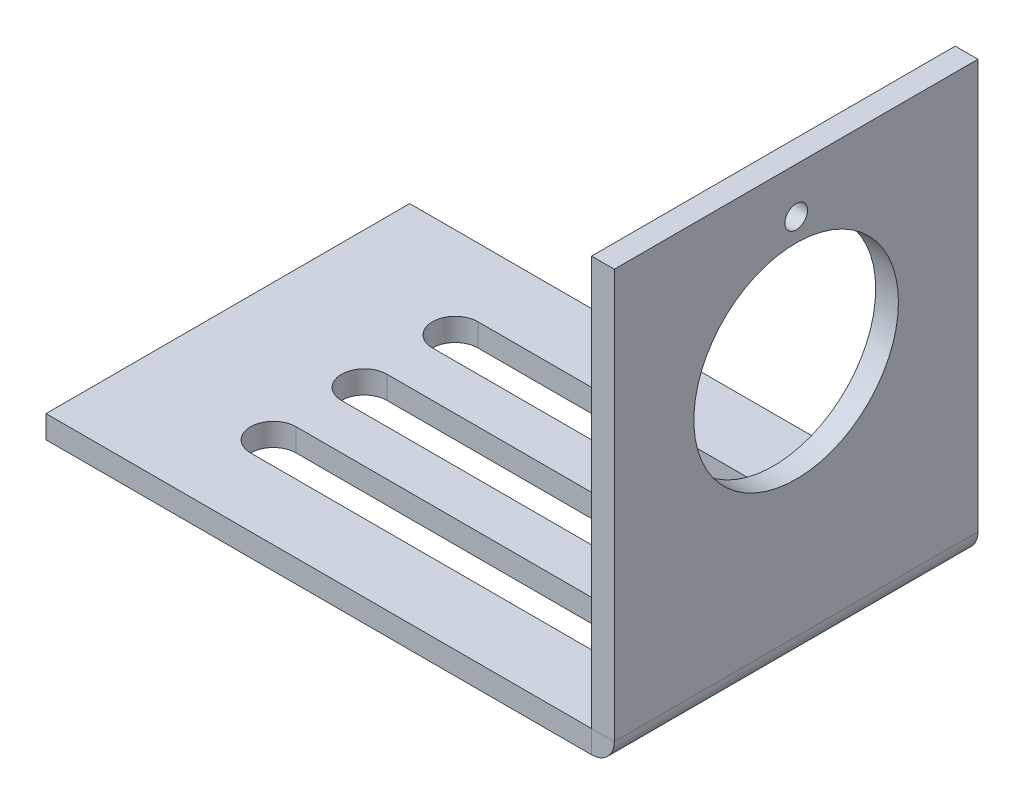
ISO-10303-21;
HEADER;
FILE_DESCRIPTION(('STEP AP214'),'2;1');
FILE_NAME('part.step','',(''),(''),'','','');
FILE_SCHEMA(('AUTOMOTIVE_DESIGN { 1 0 10303 214 1 1 1 1 }'));
ENDSEC;
DATA;
#1=APPLICATION_CONTEXT('core data for automotive mechanical design processes');
#2=APPLICATION_PROTOCOL_DEFINITION('international standard','automotive_design',2000,#1);
#3=PRODUCT_CONTEXT('',#1,'mechanical');
#4=PRODUCT('Part','Part','',(#3));
#5=PRODUCT_RELATED_PRODUCT_CATEGORY('part','',(#4));
#6=PRODUCT_DEFINITION_FORMATION('','',#4);
#7=PRODUCT_DEFINITION_CONTEXT('part definition',#1,'design');
#8=PRODUCT_DEFINITION('design','',#6,#7);
#9=PRODUCT_DEFINITION_SHAPE('','',#8);
#10=(LENGTH_UNIT() NAMED_UNIT(*) SI_UNIT(.MILLI.,.METRE.));
#11=(NAMED_UNIT(*) PLANE_ANGLE_UNIT() SI_UNIT($,.RADIAN.));
#12=(NAMED_UNIT(*) SI_UNIT($,.STERADIAN.) SOLID_ANGLE_UNIT());
#13=UNCERTAINTY_MEASURE_WITH_UNIT(LENGTH_MEASURE(1.E-05),#10,'distance_accuracy_value','');
#14=(GEOMETRIC_REPRESENTATION_CONTEXT(3) GLOBAL_UNCERTAINTY_ASSIGNED_CONTEXT((#13)) GLOBAL_UNIT_ASSIGNED_CONTEXT((#10,
#11,#12)) REPRESENTATION_CONTEXT('',''));
#15=CARTESIAN_POINT('',(0.,0.,0.));
#16=DIRECTION('',(0.,0.,1.));
#17=DIRECTION('',(1.,0.,0.));
#18=AXIS2_PLACEMENT_3D('',#15,#16,#17);
#19=CARTESIAN_POINT('',(19.05,1.5875,-12.7));
#20=DIRECTION('',(0.,0.,1.));
#21=DIRECTION('',(1.,0.,0.));
#22=AXIS2_PLACEMENT_3D('',#19,#20,#21);
#23=CYLINDRICAL_SURFACE('',#22,1.5875);
#24=CARTESIAN_POINT('',(19.05,1.5875,12.7));
#25=DIRECTION('',(0.,0.,1.));
#26=DIRECTION('',(1.,0.,0.));
#27=AXIS2_PLACEMENT_3D('',#24,#25,#26);
#28=CIRCLE('',#27,1.5875);
#29=CARTESIAN_POINT('',(19.05,0.,12.7));
#30=VERTEX_POINT('',#29);
#31=CARTESIAN_POINT('',(20.6375,1.5875,12.7));
#32=VERTEX_POINT('',#31);
#33=EDGE_CURVE('E96',#30,#32,#28,.T.);
#34=ORIENTED_EDGE('',*,*,#33,.F.);
#35=DIRECTION('',(0.,0.,1.));
#36=VECTOR('',#35,1.);
#37=CARTESIAN_POINT('',(19.05,0.,-12.7));
#38=LINE('',#37,#36);
#39=CARTESIAN_POINT('',(19.05,0.,-12.7));
#40=VERTEX_POINT('',#39);
#41=EDGE_CURVE('E12',#40,#30,#38,.T.);
#42=ORIENTED_EDGE('',*,*,#41,.F.);
#43=CARTESIAN_POINT('',(19.05,1.5875,-12.7));
#44=DIRECTION('',(0.,0.,1.));
#45=DIRECTION('',(1.,0.,0.));
#46=AXIS2_PLACEMENT_3D('',#43,#44,#45);
#47=CIRCLE('',#46,1.5875);
#48=CARTESIAN_POINT('',(20.6375,1.5875,-12.7));
#49=VERTEX_POINT('',#48);
#50=EDGE_CURVE('E88',#40,#49,#47,.T.);
#51=ORIENTED_EDGE('',*,*,#50,.T.);
#52=DIRECTION('',(0.,0.,1.));
#53=VECTOR('',#52,1.);
#54=CARTESIAN_POINT('',(20.6375,1.5875,-12.7));
#55=LINE('',#54,#53);
#56=EDGE_CURVE('E47',#49,#32,#55,.T.);
#57=ORIENTED_EDGE('',*,*,#56,.T.);
#58=EDGE_LOOP('',(#34,#42,#51,#57));
#59=FACE_BOUND('',#58,.T.);
#60=ADVANCED_FACE('F44',(#59),#23,.T.);
#61=CARTESIAN_POINT('',(19.05,1.5875,-12.7));
#62=DIRECTION('',(-1.,0.,0.));
#63=DIRECTION('',(0.,0.,1.));
#64=AXIS2_PLACEMENT_3D('',#61,#62,#63);
#65=PLANE('',#64);
#66=DIRECTION('',(0.,-1.,0.));
#67=VECTOR('',#66,1.);
#68=CARTESIAN_POINT('',(19.05,1.5875,12.7));
#69=LINE('',#68,#67);
#70=CARTESIAN_POINT('',(19.05,1.5875,12.7));
#71=VERTEX_POINT('',#70);
#72=EDGE_CURVE('E90',#71,#30,#69,.T.);
#73=ORIENTED_EDGE('',*,*,#72,.F.);
#74=DIRECTION('',(0.,0.,1.));
#75=VECTOR('',#74,1.);
#76=CARTESIAN_POINT('',(19.05,1.5875,-12.7));
#77=LINE('',#76,#75);
#78=CARTESIAN_POINT('',(19.05,1.5875,-12.7));
#79=VERTEX_POINT('',#78);
#80=EDGE_CURVE('E53',#79,#71,#77,.T.);
#81=ORIENTED_EDGE('',*,*,#80,.F.);
#82=DIRECTION('',(0.,-1.,0.));
#83=VECTOR('',#82,1.);
#84=CARTESIAN_POINT('',(19.05,1.5875,-12.7));
#85=LINE('',#84,#83);
#86=EDGE_CURVE('E85',#79,#40,#85,.T.);
#87=ORIENTED_EDGE('',*,*,#86,.T.);
#88=ORIENTED_EDGE('',*,*,#41,.T.);
#89=EDGE_LOOP('',(#73,#81,#87,#88));
#90=FACE_BOUND('',#89,.T.);
#91=ADVANCED_FACE('F100',(#90),#65,.T.);
#92=CARTESIAN_POINT('',(20.6375,1.5875,-12.7));
#93=DIRECTION('',(0.,1.,0.));
#94=DIRECTION('',(-1.,0.,0.));
#95=AXIS2_PLACEMENT_3D('',#92,#93,#94);
#96=PLANE('',#95);
#97=DIRECTION('',(-1.,0.,0.));
#98=VECTOR('',#97,1.);
#99=CARTESIAN_POINT('',(20.6375,1.5875,12.7));
#100=LINE('',#99,#98);
#101=EDGE_CURVE('E83',#32,#71,#100,.T.);
#102=ORIENTED_EDGE('',*,*,#101,.F.);
#103=ORIENTED_EDGE('',*,*,#56,.F.);
#104=DIRECTION('',(-1.,0.,0.));
#105=VECTOR('',#104,1.);
#106=CARTESIAN_POINT('',(20.6375,1.5875,-12.7));
#107=LINE('',#106,#105);
#108=EDGE_CURVE('E81',#49,#79,#107,.T.);
#109=ORIENTED_EDGE('',*,*,#108,.T.);
#110=ORIENTED_EDGE('',*,*,#80,.T.);
#111=EDGE_LOOP('',(#102,#103,#109,#110));
#112=FACE_BOUND('',#111,.T.);
#113=ADVANCED_FACE('F80',(#112),#96,.T.);
#114=CARTESIAN_POINT('',(19.05,1.5875,-12.7));
#115=DIRECTION('',(0.,0.,1.));
#116=DIRECTION('',(1.,0.,0.));
#117=AXIS2_PLACEMENT_3D('',#114,#115,#116);
#118=PLANE('',#117);
#119=ORIENTED_EDGE('',*,*,#50,.F.);
#120=ORIENTED_EDGE('',*,*,#86,.F.);
#121=ORIENTED_EDGE('',*,*,#108,.F.);
#122=EDGE_LOOP('',(#119,#120,#121));
#123=FACE_BOUND('',#122,.T.);
#124=ADVANCED_FACE('F87',(#123),#118,.F.);
#125=CARTESIAN_POINT('',(19.05,1.5875,12.7));
#126=DIRECTION('',(0.,0.,1.));
#127=DIRECTION('',(1.,0.,0.));
#128=AXIS2_PLACEMENT_3D('',#125,#126,#127);
#129=PLANE('',#128);
#130=ORIENTED_EDGE('',*,*,#33,.T.);
#131=ORIENTED_EDGE('',*,*,#101,.T.);
#132=ORIENTED_EDGE('',*,*,#72,.T.);
#133=EDGE_LOOP('',(#130,#131,#132));
#134=FACE_BOUND('',#133,.T.);
#135=ADVANCED_FACE('F99',(#134),#129,.T.);
#136=CLOSED_SHELL('',(#60,#91,#113,#124,#135));
#137=MANIFOLD_SOLID_BREP('B2',#136);
#138=CARTESIAN_POINT('',(19.05,1.5875,-12.7));
#139=DIRECTION('',(-1.,0.,0.));
#140=DIRECTION('',(0.,0.,1.));
#141=AXIS2_PLACEMENT_3D('',#138,#139,#140);
#142=PLANE('',#141);
#143=CARTESIAN_POINT('',(19.05,26.9875,0.));
#144=DIRECTION('',(-1.,0.,0.));
#145=DIRECTION('',(0.,0.,1.));
#146=AXIS2_PLACEMENT_3D('',#143,#144,#145);
#147=CIRCLE('',#146,0.79375);
#148=CARTESIAN_POINT('',(19.05,26.9875,0.79375));
#149=VERTEX_POINT('',#148);
#150=EDGE_CURVE('E259',#149,#149,#147,.T.);
#151=ORIENTED_EDGE('',*,*,#150,.F.);
#152=EDGE_LOOP('',(#151));
#153=FACE_BOUND('',#152,.T.);
#154=CARTESIAN_POINT('',(19.05,18.25625,0.));
#155=DIRECTION('',(-1.,0.,0.));
#156=DIRECTION('',(0.,0.,1.));
#157=AXIS2_PLACEMENT_3D('',#154,#155,#156);
#158=CIRCLE('',#157,7.14375);
#159=CARTESIAN_POINT('',(19.05,18.25625,7.14375));
#160=VERTEX_POINT('',#159);
#161=EDGE_CURVE('E220',#160,#160,#158,.T.);
#162=ORIENTED_EDGE('',*,*,#161,.F.);
#163=EDGE_LOOP('',(#162));
#164=FACE_BOUND('',#163,.T.);
#165=DIRECTION('',(0.,-1.,0.));
#166=VECTOR('',#165,1.);
#167=CARTESIAN_POINT('',(19.05,1.5875,12.7));
#168=LINE('',#167,#166);
#169=CARTESIAN_POINT('',(19.05,30.1625,12.7));
#170=VERTEX_POINT('',#169);
#171=CARTESIAN_POINT('',(19.05,1.5875,12.7));
#172=VERTEX_POINT('',#171);
#173=EDGE_CURVE('E216',#170,#172,#168,.T.);
#174=ORIENTED_EDGE('',*,*,#173,.F.);
#175=DIRECTION('',(0.,0.,1.));
#176=VECTOR('',#175,1.);
#177=CARTESIAN_POINT('',(19.05,30.1625,-12.7));
#178=LINE('',#177,#176);
#179=CARTESIAN_POINT('',(19.05,30.1625,-12.7));
#180=VERTEX_POINT('',#179);
#181=EDGE_CURVE('E42',#180,#170,#178,.T.);
#182=ORIENTED_EDGE('',*,*,#181,.F.);
#183=DIRECTION('',(0.,-1.,0.));
#184=VECTOR('',#183,1.);
#185=CARTESIAN_POINT('',(19.05,1.5875,-12.7));
#186=LINE('',#185,#184);
#187=CARTESIAN_POINT('',(19.05,1.5875,-12.7));
#188=VERTEX_POINT('',#187);
#189=EDGE_CURVE('E209',#180,#188,#186,.T.);
#190=ORIENTED_EDGE('',*,*,#189,.T.);
#191=DIRECTION('',(0.,0.,1.));
#192=VECTOR('',#191,1.);
#193=CARTESIAN_POINT('',(19.05,1.5875,-12.7));
#194=LINE('',#193,#192);
#195=EDGE_CURVE('E154',#188,#172,#194,.T.);
#196=ORIENTED_EDGE('',*,*,#195,.T.);
#197=EDGE_LOOP('',(#174,#182,#190,#196));
#198=FACE_BOUND('',#197,.T.);
#199=ADVANCED_FACE('F151',(#153,#164,#198),#142,.T.);
#200=CARTESIAN_POINT('',(19.05,30.1625,-12.7));
#201=DIRECTION('',(0.,1.,0.));
#202=DIRECTION('',(0.,0.,1.));
#203=AXIS2_PLACEMENT_3D('',#200,#201,#202);
#204=PLANE('',#203);
#205=DIRECTION('',(-1.,0.,0.));
#206=VECTOR('',#205,1.);
#207=CARTESIAN_POINT('',(19.05,30.1625,12.7));
#208=LINE('',#207,#206);
#209=CARTESIAN_POINT('',(20.6375,30.1625,12.7));
#210=VERTEX_POINT('',#209);
#211=EDGE_CURVE('E211',#210,#170,#208,.T.);
#212=ORIENTED_EDGE('',*,*,#211,.F.);
#213=DIRECTION('',(0.,0.,1.));
#214=VECTOR('',#213,1.);
#215=CARTESIAN_POINT('',(20.6375,30.1625,-12.7));
#216=LINE('',#215,#214);
#217=CARTESIAN_POINT('',(20.6375,30.1625,-12.7));
#218=VERTEX_POINT('',#217);
#219=EDGE_CURVE('E160',#218,#210,#216,.T.);
#220=ORIENTED_EDGE('',*,*,#219,.F.);
#221=DIRECTION('',(-1.,0.,0.));
#222=VECTOR('',#221,1.);
#223=CARTESIAN_POINT('',(19.05,30.1625,-12.7));
#224=LINE('',#223,#222);
#225=EDGE_CURVE('E206',#218,#180,#224,.T.);
#226=ORIENTED_EDGE('',*,*,#225,.T.);
#227=ORIENTED_EDGE('',*,*,#181,.T.);
#228=EDGE_LOOP('',(#212,#220,#226,#227));
#229=FACE_BOUND('',#228,.T.);
#230=ADVANCED_FACE('F227',(#229),#204,.T.);
#231=CARTESIAN_POINT('',(20.6375,1.5875,-12.7));
#232=DIRECTION('',(1.,0.,0.));
#233=DIRECTION('',(0.,0.,-1.));
#234=AXIS2_PLACEMENT_3D('',#231,#232,#233);
#235=PLANE('',#234);
#236=CARTESIAN_POINT('',(20.6375,26.9875,0.));
#237=DIRECTION('',(1.,0.,0.));
#238=DIRECTION('',(0.,0.,-1.));
#239=AXIS2_PLACEMENT_3D('',#236,#237,#238);
#240=CIRCLE('',#239,0.79375);
#241=CARTESIAN_POINT('',(20.6375,26.9875,-0.79375));
#242=VERTEX_POINT('',#241);
#243=EDGE_CURVE('E262',#242,#242,#240,.T.);
#244=ORIENTED_EDGE('',*,*,#243,.F.);
#245=EDGE_LOOP('',(#244));
#246=FACE_BOUND('',#245,.T.);
#247=CARTESIAN_POINT('',(20.6375,18.25625,0.));
#248=DIRECTION('',(1.,0.,0.));
#249=DIRECTION('',(0.,0.,-1.));
#250=AXIS2_PLACEMENT_3D('',#247,#248,#249);
#251=CIRCLE('',#250,7.14375);
#252=CARTESIAN_POINT('',(20.6375,18.25625,-7.14375));
#253=VERTEX_POINT('',#252);
#254=EDGE_CURVE('E264',#253,#253,#251,.T.);
#255=ORIENTED_EDGE('',*,*,#254,.F.);
#256=EDGE_LOOP('',(#255));
#257=FACE_BOUND('',#256,.T.);
#258=DIRECTION('',(0.,1.,0.));
#259=VECTOR('',#258,1.);
#260=CARTESIAN_POINT('',(20.6375,1.5875,12.7));
#261=LINE('',#260,#259);
#262=CARTESIAN_POINT('',(20.6375,1.5875,12.7));
#263=VERTEX_POINT('',#262);
#264=EDGE_CURVE('E201',#263,#210,#261,.T.);
#265=ORIENTED_EDGE('',*,*,#264,.F.);
#266=DIRECTION('',(0.,0.,1.));
#267=VECTOR('',#266,1.);
#268=CARTESIAN_POINT('',(20.6375,1.5875,-12.7));
#269=LINE('',#268,#267);
#270=CARTESIAN_POINT('',(20.6375,1.5875,-12.7));
#271=VERTEX_POINT('',#270);
#272=EDGE_CURVE('E196',#271,#263,#269,.T.);
#273=ORIENTED_EDGE('',*,*,#272,.F.);
#274=DIRECTION('',(0.,1.,0.));
#275=VECTOR('',#274,1.);
#276=CARTESIAN_POINT('',(20.6375,1.5875,-12.7));
#277=LINE('',#276,#275);
#278=EDGE_CURVE('E199',#271,#218,#277,.T.);
#279=ORIENTED_EDGE('',*,*,#278,.T.);
#280=ORIENTED_EDGE('',*,*,#219,.T.);
#281=EDGE_LOOP('',(#265,#273,#279,#280));
#282=FACE_BOUND('',#281,.T.);
#283=ADVANCED_FACE('F198',(#246,#257,#282),#235,.T.);
#284=CARTESIAN_POINT('',(19.05,1.5875,-12.7));
#285=DIRECTION('',(0.,-1.,0.));
#286=DIRECTION('',(0.,0.,-1.));
#287=AXIS2_PLACEMENT_3D('',#284,#285,#286);
#288=PLANE('',#287);
#289=DIRECTION('',(1.,0.,0.));
#290=VECTOR('',#289,1.);
#291=CARTESIAN_POINT('',(19.05,1.5875,12.7));
#292=LINE('',#291,#290);
#293=EDGE_CURVE('E219',#172,#263,#292,.T.);
#294=ORIENTED_EDGE('',*,*,#293,.F.);
#295=ORIENTED_EDGE('',*,*,#195,.F.);
#296=DIRECTION('',(1.,0.,0.));
#297=VECTOR('',#296,1.);
#298=CARTESIAN_POINT('',(19.05,1.5875,-12.7));
#299=LINE('',#298,#297);
#300=EDGE_CURVE('E205',#188,#271,#299,.T.);
#301=ORIENTED_EDGE('',*,*,#300,.T.);
#302=ORIENTED_EDGE('',*,*,#272,.T.);
#303=EDGE_LOOP('',(#294,#295,#301,#302));
#304=FACE_BOUND('',#303,.T.);
#305=ADVANCED_FACE('F208',(#304),#288,.T.);
#306=CARTESIAN_POINT('',(19.05,30.1625,-12.7));
#307=DIRECTION('',(0.,0.,-1.));
#308=DIRECTION('',(-1.,0.,0.));
#309=AXIS2_PLACEMENT_3D('',#306,#307,#308);
#310=PLANE('',#309);
#311=ORIENTED_EDGE('',*,*,#189,.F.);
#312=ORIENTED_EDGE('',*,*,#225,.F.);
#313=ORIENTED_EDGE('',*,*,#278,.F.);
#314=ORIENTED_EDGE('',*,*,#300,.F.);
#315=EDGE_LOOP('',(#311,#312,#313,#314));
#316=FACE_BOUND('',#315,.T.);
#317=ADVANCED_FACE('F204',(#316),#310,.T.);
#318=CARTESIAN_POINT('',(19.05,30.1625,12.7));
#319=DIRECTION('',(0.,0.,-1.));
#320=DIRECTION('',(-1.,0.,0.));
#321=AXIS2_PLACEMENT_3D('',#318,#319,#320);
#322=PLANE('',#321);
#323=ORIENTED_EDGE('',*,*,#173,.T.);
#324=ORIENTED_EDGE('',*,*,#293,.T.);
#325=ORIENTED_EDGE('',*,*,#264,.T.);
#326=ORIENTED_EDGE('',*,*,#211,.T.);
#327=EDGE_LOOP('',(#323,#324,#325,#326));
#328=FACE_BOUND('',#327,.T.);
#329=ADVANCED_FACE('F226',(#328),#322,.F.);
#330=CARTESIAN_POINT('',(-4.7625,18.25625,0.));
#331=DIRECTION('',(1.,0.,0.));
#332=DIRECTION('',(0.,0.,-1.));
#333=AXIS2_PLACEMENT_3D('',#330,#331,#332);
#334=CYLINDRICAL_SURFACE('',#333,7.14375);
#335=ORIENTED_EDGE('',*,*,#161,.T.);
#336=EDGE_LOOP('',(#335));
#337=FACE_BOUND('',#336,.T.);
#338=ORIENTED_EDGE('',*,*,#254,.T.);
#339=EDGE_LOOP('',(#338));
#340=FACE_BOUND('',#339,.T.);
#341=ADVANCED_FACE('F246',(#337,#340),#334,.F.);
#342=CARTESIAN_POINT('',(-4.7625,26.9875,0.));
#343=DIRECTION('',(1.,0.,0.));
#344=DIRECTION('',(0.,0.,-1.));
#345=AXIS2_PLACEMENT_3D('',#342,#343,#344);
#346=CYLINDRICAL_SURFACE('',#345,0.79375);
#347=ORIENTED_EDGE('',*,*,#150,.T.);
#348=EDGE_LOOP('',(#347));
#349=FACE_BOUND('',#348,.T.);
#350=ORIENTED_EDGE('',*,*,#243,.T.);
#351=EDGE_LOOP('',(#350));
#352=FACE_BOUND('',#351,.T.);
#353=ADVANCED_FACE('F250',(#349,#352),#346,.F.);
#354=CLOSED_SHELL('',(#199,#230,#283,#305,#317,#329,#341,#353));
#355=MANIFOLD_SOLID_BREP('B6',#354);
#356=CARTESIAN_POINT('',(19.05,1.5875,12.7));
#357=DIRECTION('',(-1.,0.,0.));
#358=DIRECTION('',(0.,0.,1.));
#359=AXIS2_PLACEMENT_3D('',#356,#357,#358);
#360=PLANE('',#359);
#361=DIRECTION('',(0.,0.,-1.));
#362=VECTOR('',#361,1.);
#363=CARTESIAN_POINT('',(19.05,0.,12.7));
#364=LINE('',#363,#362);
#365=CARTESIAN_POINT('',(19.05,0.,12.7));
#366=VERTEX_POINT('',#365);
#367=CARTESIAN_POINT('',(19.05,0.,-12.7));
#368=VERTEX_POINT('',#367);
#369=EDGE_CURVE('E490',#366,#368,#364,.T.);
#370=ORIENTED_EDGE('',*,*,#369,.T.);
#371=DIRECTION('',(0.,-1.,0.));
#372=VECTOR('',#371,1.);
#373=CARTESIAN_POINT('',(19.05,1.5875,-12.7));
#374=LINE('',#373,#372);
#375=CARTESIAN_POINT('',(19.05,1.5875,-12.7));
#376=VERTEX_POINT('',#375);
#377=EDGE_CURVE('E523',#376,#368,#374,.T.);
#378=ORIENTED_EDGE('',*,*,#377,.F.);
#379=DIRECTION('',(0.,0.,-1.));
#380=VECTOR('',#379,1.);
#381=CARTESIAN_POINT('',(19.05,1.5875,12.7));
#382=LINE('',#381,#380);
#383=CARTESIAN_POINT('',(19.05,1.5875,12.7));
#384=VERTEX_POINT('',#383);
#385=EDGE_CURVE('E497',#384,#376,#382,.T.);
#386=ORIENTED_EDGE('',*,*,#385,.F.);
#387=DIRECTION('',(0.,-1.,0.));
#388=VECTOR('',#387,1.);
#389=CARTESIAN_POINT('',(19.05,1.5875,12.7));
#390=LINE('',#389,#388);
#391=EDGE_CURVE('E507',#384,#366,#390,.T.);
#392=ORIENTED_EDGE('',*,*,#391,.T.);
#393=EDGE_LOOP('',(#370,#378,#386,#392));
#394=FACE_BOUND('',#393,.T.);
#395=ADVANCED_FACE('F317',(#394),#360,.F.);
#396=CARTESIAN_POINT('',(-19.05,1.5875,-12.7));
#397=DIRECTION('',(0.,0.,1.));
#398=DIRECTION('',(1.,0.,0.));
#399=AXIS2_PLACEMENT_3D('',#396,#397,#398);
#400=PLANE('',#399);
#401=DIRECTION('',(-1.,0.,0.));
#402=VECTOR('',#401,1.);
#403=CARTESIAN_POINT('',(-19.05,0.,-12.7));
#404=LINE('',#403,#402);
#405=CARTESIAN_POINT('',(-19.05,0.,-12.7));
#406=VERTEX_POINT('',#405);
#407=EDGE_CURVE('E510',#368,#406,#404,.T.);
#408=ORIENTED_EDGE('',*,*,#407,.T.);
#409=DIRECTION('',(0.,-1.,0.));
#410=VECTOR('',#409,1.);
#411=CARTESIAN_POINT('',(-19.05,1.5875,-12.7));
#412=LINE('',#411,#410);
#413=CARTESIAN_POINT('',(-19.05,1.5875,-12.7));
#414=VERTEX_POINT('',#413);
#415=EDGE_CURVE('E520',#414,#406,#412,.T.);
#416=ORIENTED_EDGE('',*,*,#415,.F.);
#417=DIRECTION('',(-1.,0.,0.));
#418=VECTOR('',#417,1.);
#419=CARTESIAN_POINT('',(-19.05,1.5875,-12.7));
#420=LINE('',#419,#418);
#421=EDGE_CURVE('E500',#376,#414,#420,.T.);
#422=ORIENTED_EDGE('',*,*,#421,.F.);
#423=ORIENTED_EDGE('',*,*,#377,.T.);
#424=EDGE_LOOP('',(#408,#416,#422,#423));
#425=FACE_BOUND('',#424,.T.);
#426=ADVANCED_FACE('F569',(#425),#400,.F.);
#427=CARTESIAN_POINT('',(-19.05,1.5875,12.7));
#428=DIRECTION('',(1.,0.,0.));
#429=DIRECTION('',(0.,0.,-1.));
#430=AXIS2_PLACEMENT_3D('',#427,#428,#429);
#431=PLANE('',#430);
#432=DIRECTION('',(0.,0.,1.));
#433=VECTOR('',#432,1.);
#434=CARTESIAN_POINT('',(-19.05,0.,12.7));
#435=LINE('',#434,#433);
#436=CARTESIAN_POINT('',(-19.05,0.,12.7));
#437=VERTEX_POINT('',#436);
#438=EDGE_CURVE('E512',#406,#437,#435,.T.);
#439=ORIENTED_EDGE('',*,*,#438,.T.);
#440=DIRECTION('',(0.,-1.,0.));
#441=VECTOR('',#440,1.);
#442=CARTESIAN_POINT('',(-19.05,1.5875,12.7));
#443=LINE('',#442,#441);
#444=CARTESIAN_POINT('',(-19.05,1.5875,12.7));
#445=VERTEX_POINT('',#444);
#446=EDGE_CURVE('E517',#445,#437,#443,.T.);
#447=ORIENTED_EDGE('',*,*,#446,.F.);
#448=DIRECTION('',(0.,0.,1.));
#449=VECTOR('',#448,1.);
#450=CARTESIAN_POINT('',(-19.05,1.5875,12.7));
#451=LINE('',#450,#449);
#452=EDGE_CURVE('E503',#414,#445,#451,.T.);
#453=ORIENTED_EDGE('',*,*,#452,.F.);
#454=ORIENTED_EDGE('',*,*,#415,.T.);
#455=EDGE_LOOP('',(#439,#447,#453,#454));
#456=FACE_BOUND('',#455,.T.);
#457=ADVANCED_FACE('F574',(#456),#431,.F.);
#458=CARTESIAN_POINT('',(-19.05,1.5875,12.7));
#459=DIRECTION('',(0.,0.,-1.));
#460=DIRECTION('',(-1.,0.,0.));
#461=AXIS2_PLACEMENT_3D('',#458,#459,#460);
#462=PLANE('',#461);
#463=DIRECTION('',(1.,0.,0.));
#464=VECTOR('',#463,1.);
#465=CARTESIAN_POINT('',(-19.05,0.,12.7));
#466=LINE('',#465,#464);
#467=EDGE_CURVE('E501',#437,#366,#466,.T.);
#468=ORIENTED_EDGE('',*,*,#467,.T.);
#469=ORIENTED_EDGE('',*,*,#391,.F.);
#470=DIRECTION('',(1.,0.,0.));
#471=VECTOR('',#470,1.);
#472=CARTESIAN_POINT('',(-19.05,1.5875,12.7));
#473=LINE('',#472,#471);
#474=EDGE_CURVE('E505',#445,#384,#473,.T.);
#475=ORIENTED_EDGE('',*,*,#474,.F.);
#476=ORIENTED_EDGE('',*,*,#446,.T.);
#477=EDGE_LOOP('',(#468,#469,#475,#476));
#478=FACE_BOUND('',#477,.T.);
#479=ADVANCED_FACE('F589',(#478),#462,.F.);
#480=CARTESIAN_POINT('',(19.05,1.5875,-12.7));
#481=DIRECTION('',(0.,-1.,0.));
#482=DIRECTION('',(0.,0.,-1.));
#483=AXIS2_PLACEMENT_3D('',#480,#481,#482);
#484=PLANE('',#483);
#485=DIRECTION('',(1.,0.,0.));
#486=VECTOR('',#485,1.);
#487=CARTESIAN_POINT('',(-9.525,1.5875,-4.7625));
#488=LINE('',#487,#486);
#489=CARTESIAN_POINT('',(-9.52499999999999,1.5875,-4.7625));
#490=VERTEX_POINT('',#489);
#491=CARTESIAN_POINT('',(15.875,1.5875,-4.7625));
#492=VERTEX_POINT('',#491);
#493=EDGE_CURVE('E440',#490,#492,#488,.T.);
#494=ORIENTED_EDGE('',*,*,#493,.F.);
#495=CARTESIAN_POINT('',(-9.525,1.5875,-6.35));
#496=DIRECTION('',(0.,1.,0.));
#497=DIRECTION('',(0.,0.,-1.));
#498=AXIS2_PLACEMENT_3D('',#495,#496,#497);
#499=CIRCLE('',#498,1.5875);
#500=CARTESIAN_POINT('',(-9.525,1.5875,-7.9375));
#501=VERTEX_POINT('',#500);
#502=EDGE_CURVE('E331',#501,#490,#499,.T.);
#503=ORIENTED_EDGE('',*,*,#502,.F.);
#504=DIRECTION('',(-1.,0.,0.));
#505=VECTOR('',#504,1.);
#506=CARTESIAN_POINT('',(-9.525,1.5875,-7.9375));
#507=LINE('',#506,#505);
#508=CARTESIAN_POINT('',(15.875,1.5875,-7.9375));
#509=VERTEX_POINT('',#508);
#510=EDGE_CURVE('E447',#509,#501,#507,.T.);
#511=ORIENTED_EDGE('',*,*,#510,.F.);
#512=CARTESIAN_POINT('',(15.875,1.5875,-6.35));
#513=DIRECTION('',(0.,1.,0.));
#514=DIRECTION('',(0.,0.,1.));
#515=AXIS2_PLACEMENT_3D('',#512,#513,#514);
#516=CIRCLE('',#515,1.5875);
#517=EDGE_CURVE('E431',#492,#509,#516,.T.);
#518=ORIENTED_EDGE('',*,*,#517,.F.);
#519=EDGE_LOOP('',(#494,#503,#511,#518));
#520=FACE_BOUND('',#519,.T.);
#521=DIRECTION('',(1.,0.,0.));
#522=VECTOR('',#521,1.);
#523=CARTESIAN_POINT('',(-9.525,1.5875,1.5875));
#524=LINE('',#523,#522);
#525=CARTESIAN_POINT('',(-9.52499999999999,1.5875,1.5875));
#526=VERTEX_POINT('',#525);
#527=CARTESIAN_POINT('',(15.875,1.5875,1.5875));
#528=VERTEX_POINT('',#527);
#529=EDGE_CURVE('E458',#526,#528,#524,.T.);
#530=ORIENTED_EDGE('',*,*,#529,.F.);
#531=CARTESIAN_POINT('',(-9.525,1.5875,0.));
#532=DIRECTION('',(0.,1.,0.));
#533=DIRECTION('',(0.,0.,-1.));
#534=AXIS2_PLACEMENT_3D('',#531,#532,#533);
#535=CIRCLE('',#534,1.5875);
#536=CARTESIAN_POINT('',(-9.525,1.5875,-1.5875));
#537=VERTEX_POINT('',#536);
#538=EDGE_CURVE('E454',#537,#526,#535,.T.);
#539=ORIENTED_EDGE('',*,*,#538,.F.);
#540=DIRECTION('',(-1.,0.,0.));
#541=VECTOR('',#540,1.);
#542=CARTESIAN_POINT('',(-9.525,1.5875,-1.5875));
#543=LINE('',#542,#541);
#544=CARTESIAN_POINT('',(15.875,1.5875,-1.5875));
#545=VERTEX_POINT('',#544);
#546=EDGE_CURVE('E464',#545,#537,#543,.T.);
#547=ORIENTED_EDGE('',*,*,#546,.F.);
#548=CARTESIAN_POINT('',(15.875,1.5875,0.));
#549=DIRECTION('',(0.,1.,0.));
#550=DIRECTION('',(0.,0.,1.));
#551=AXIS2_PLACEMENT_3D('',#548,#549,#550);
#552=CIRCLE('',#551,1.5875);
#553=EDGE_CURVE('E461',#528,#545,#552,.T.);
#554=ORIENTED_EDGE('',*,*,#553,.F.);
#555=EDGE_LOOP('',(#530,#539,#547,#554));
#556=FACE_BOUND('',#555,.T.);
#557=DIRECTION('',(1.,0.,0.));
#558=VECTOR('',#557,1.);
#559=CARTESIAN_POINT('',(-9.525,1.5875,7.9375));
#560=LINE('',#559,#558);
#561=CARTESIAN_POINT('',(-9.52499999999999,1.5875,7.9375));
#562=VERTEX_POINT('',#561);
#563=CARTESIAN_POINT('',(15.875,1.5875,7.9375));
#564=VERTEX_POINT('',#563);
#565=EDGE_CURVE('E478',#562,#564,#560,.T.);
#566=ORIENTED_EDGE('',*,*,#565,.F.);
#567=CARTESIAN_POINT('',(-9.525,1.5875,6.35));
#568=DIRECTION('',(0.,1.,0.));
#569=DIRECTION('',(0.,0.,-1.));
#570=AXIS2_PLACEMENT_3D('',#567,#568,#569);
#571=CIRCLE('',#570,1.5875);
#572=CARTESIAN_POINT('',(-9.525,1.5875,4.7625));
#573=VERTEX_POINT('',#572);
#574=EDGE_CURVE('E470',#573,#562,#571,.T.);
#575=ORIENTED_EDGE('',*,*,#574,.F.);
#576=DIRECTION('',(-1.,0.,0.));
#577=VECTOR('',#576,1.);
#578=CARTESIAN_POINT('',(-9.525,1.5875,4.7625));
#579=LINE('',#578,#577);
#580=CARTESIAN_POINT('',(15.875,1.5875,4.7625));
#581=VERTEX_POINT('',#580);
#582=EDGE_CURVE('E484',#581,#573,#579,.T.);
#583=ORIENTED_EDGE('',*,*,#582,.F.);
#584=CARTESIAN_POINT('',(15.875,1.5875,6.35));
#585=DIRECTION('',(0.,1.,0.));
#586=DIRECTION('',(0.,0.,1.));
#587=AXIS2_PLACEMENT_3D('',#584,#585,#586);
#588=CIRCLE('',#587,1.5875);
#589=EDGE_CURVE('E481',#564,#581,#588,.T.);
#590=ORIENTED_EDGE('',*,*,#589,.F.);
#591=EDGE_LOOP('',(#566,#575,#583,#590));
#592=FACE_BOUND('',#591,.T.);
#593=ORIENTED_EDGE('',*,*,#385,.T.);
#594=ORIENTED_EDGE('',*,*,#421,.T.);
#595=ORIENTED_EDGE('',*,*,#452,.T.);
#596=ORIENTED_EDGE('',*,*,#474,.T.);
#597=EDGE_LOOP('',(#593,#594,#595,#596));
#598=FACE_BOUND('',#597,.T.);
#599=ADVANCED_FACE('F444',(#520,#556,#592,#598),#484,.F.);
#600=CARTESIAN_POINT('',(19.05,0.,-12.7));
#601=DIRECTION('',(0.,-1.,0.));
#602=DIRECTION('',(0.,0.,-1.));
#603=AXIS2_PLACEMENT_3D('',#600,#601,#602);
#604=PLANE('',#603);
#605=CARTESIAN_POINT('',(-9.525,0.,-6.35));
#606=DIRECTION('',(0.,-1.,0.));
#607=DIRECTION('',(0.,0.,-1.));
#608=AXIS2_PLACEMENT_3D('',#605,#606,#607);
#609=CIRCLE('',#608,1.5875);
#610=CARTESIAN_POINT('',(-9.525,0.,-4.7625));
#611=VERTEX_POINT('',#610);
#612=CARTESIAN_POINT('',(-9.525,0.,-7.9375));
#613=VERTEX_POINT('',#612);
#614=EDGE_CURVE('E149',#611,#613,#609,.T.);
#615=ORIENTED_EDGE('',*,*,#614,.F.);
#616=DIRECTION('',(-1.,0.,0.));
#617=VECTOR('',#616,1.);
#618=CARTESIAN_POINT('',(19.05,0.,-4.7625));
#619=LINE('',#618,#617);
#620=CARTESIAN_POINT('',(15.875,0.,-4.7625));
#621=VERTEX_POINT('',#620);
#622=EDGE_CURVE('E544',#621,#611,#619,.T.);
#623=ORIENTED_EDGE('',*,*,#622,.F.);
#624=CARTESIAN_POINT('',(15.875,0.,-6.35));
#625=DIRECTION('',(0.,-1.,0.));
#626=DIRECTION('',(0.,0.,-1.));
#627=AXIS2_PLACEMENT_3D('',#624,#625,#626);
#628=CIRCLE('',#627,1.5875);
#629=CARTESIAN_POINT('',(15.875,0.,-7.9375));
#630=VERTEX_POINT('',#629);
#631=EDGE_CURVE('E434',#630,#621,#628,.T.);
#632=ORIENTED_EDGE('',*,*,#631,.F.);
#633=DIRECTION('',(1.,0.,0.));
#634=VECTOR('',#633,1.);
#635=CARTESIAN_POINT('',(19.05,0.,-7.9375));
#636=LINE('',#635,#634);
#637=EDGE_CURVE('E324',#613,#630,#636,.T.);
#638=ORIENTED_EDGE('',*,*,#637,.F.);
#639=EDGE_LOOP('',(#615,#623,#632,#638));
#640=FACE_BOUND('',#639,.T.);
#641=CARTESIAN_POINT('',(-9.525,0.,0.));
#642=DIRECTION('',(0.,-1.,0.));
#643=DIRECTION('',(0.,0.,-1.));
#644=AXIS2_PLACEMENT_3D('',#641,#642,#643);
#645=CIRCLE('',#644,1.5875);
#646=CARTESIAN_POINT('',(-9.525,0.,1.5875));
#647=VERTEX_POINT('',#646);
#648=CARTESIAN_POINT('',(-9.525,0.,-1.5875));
#649=VERTEX_POINT('',#648);
#650=EDGE_CURVE('E542',#647,#649,#645,.T.);
#651=ORIENTED_EDGE('',*,*,#650,.F.);
#652=DIRECTION('',(-1.,0.,0.));
#653=VECTOR('',#652,1.);
#654=CARTESIAN_POINT('',(19.05,0.,1.5875));
#655=LINE('',#654,#653);
#656=CARTESIAN_POINT('',(15.875,0.,1.5875));
#657=VERTEX_POINT('',#656);
#658=EDGE_CURVE('E535',#657,#647,#655,.T.);
#659=ORIENTED_EDGE('',*,*,#658,.F.);
#660=CARTESIAN_POINT('',(15.875,0.,0.));
#661=DIRECTION('',(0.,-1.,0.));
#662=DIRECTION('',(0.,0.,-1.));
#663=AXIS2_PLACEMENT_3D('',#660,#661,#662);
#664=CIRCLE('',#663,1.5875);
#665=CARTESIAN_POINT('',(15.875,0.,-1.5875));
#666=VERTEX_POINT('',#665);
#667=EDGE_CURVE('E537',#666,#657,#664,.T.);
#668=ORIENTED_EDGE('',*,*,#667,.F.);
#669=DIRECTION('',(1.,0.,0.));
#670=VECTOR('',#669,1.);
#671=CARTESIAN_POINT('',(19.05,0.,-1.5875));
#672=LINE('',#671,#670);
#673=EDGE_CURVE('E540',#649,#666,#672,.T.);
#674=ORIENTED_EDGE('',*,*,#673,.F.);
#675=EDGE_LOOP('',(#651,#659,#668,#674));
#676=FACE_BOUND('',#675,.T.);
#677=CARTESIAN_POINT('',(-9.525,0.,6.35));
#678=DIRECTION('',(0.,-1.,0.));
#679=DIRECTION('',(0.,0.,-1.));
#680=AXIS2_PLACEMENT_3D('',#677,#678,#679);
#681=CIRCLE('',#680,1.5875);
#682=CARTESIAN_POINT('',(-9.525,0.,7.9375));
#683=VERTEX_POINT('',#682);
#684=CARTESIAN_POINT('',(-9.525,0.,4.7625));
#685=VERTEX_POINT('',#684);
#686=EDGE_CURVE('E533',#683,#685,#681,.T.);
#687=ORIENTED_EDGE('',*,*,#686,.F.);
#688=DIRECTION('',(-1.,0.,0.));
#689=VECTOR('',#688,1.);
#690=CARTESIAN_POINT('',(19.05,0.,7.9375));
#691=LINE('',#690,#689);
#692=CARTESIAN_POINT('',(15.875,0.,7.9375));
#693=VERTEX_POINT('',#692);
#694=EDGE_CURVE('E526',#693,#683,#691,.T.);
#695=ORIENTED_EDGE('',*,*,#694,.F.);
#696=CARTESIAN_POINT('',(15.875,0.,6.35));
#697=DIRECTION('',(0.,-1.,0.));
#698=DIRECTION('',(0.,0.,-1.));
#699=AXIS2_PLACEMENT_3D('',#696,#697,#698);
#700=CIRCLE('',#699,1.5875);
#701=CARTESIAN_POINT('',(15.875,0.,4.7625));
#702=VERTEX_POINT('',#701);
#703=EDGE_CURVE('E528',#702,#693,#700,.T.);
#704=ORIENTED_EDGE('',*,*,#703,.F.);
#705=DIRECTION('',(1.,0.,0.));
#706=VECTOR('',#705,1.);
#707=CARTESIAN_POINT('',(19.05,0.,4.7625));
#708=LINE('',#707,#706);
#709=EDGE_CURVE('E531',#685,#702,#708,.T.);
#710=ORIENTED_EDGE('',*,*,#709,.F.);
#711=EDGE_LOOP('',(#687,#695,#704,#710));
#712=FACE_BOUND('',#711,.T.);
#713=ORIENTED_EDGE('',*,*,#369,.F.);
#714=ORIENTED_EDGE('',*,*,#467,.F.);
#715=ORIENTED_EDGE('',*,*,#438,.F.);
#716=ORIENTED_EDGE('',*,*,#407,.F.);
#717=EDGE_LOOP('',(#713,#714,#715,#716));
#718=FACE_BOUND('',#717,.T.);
#719=ADVANCED_FACE('F552',(#640,#676,#712,#718),#604,.T.);
#720=CARTESIAN_POINT('',(-9.525,-23.8125,6.35));
#721=DIRECTION('',(0.,1.,0.));
#722=DIRECTION('',(0.,0.,1.));
#723=AXIS2_PLACEMENT_3D('',#720,#721,#722);
#724=CYLINDRICAL_SURFACE('',#723,1.5875);
#725=ORIENTED_EDGE('',*,*,#686,.T.);
#726=DIRECTION('',(0.,1.,0.));
#727=VECTOR('',#726,1.);
#728=CARTESIAN_POINT('',(-9.525,-23.8125,4.7625));
#729=LINE('',#728,#727);
#730=EDGE_CURVE('E488',#685,#573,#729,.T.);
#731=ORIENTED_EDGE('',*,*,#730,.T.);
#732=ORIENTED_EDGE('',*,*,#574,.T.);
#733=DIRECTION('',(0.,1.,0.));
#734=VECTOR('',#733,1.);
#735=CARTESIAN_POINT('',(-9.525,-23.8125,7.9375));
#736=LINE('',#735,#734);
#737=EDGE_CURVE('E487',#683,#562,#736,.T.);
#738=ORIENTED_EDGE('',*,*,#737,.F.);
#739=EDGE_LOOP('',(#725,#731,#732,#738));
#740=FACE_BOUND('',#739,.T.);
#741=ADVANCED_FACE('F600',(#740),#724,.F.);
#742=CARTESIAN_POINT('',(-9.525,-23.8125,4.7625));
#743=DIRECTION('',(0.,0.,-1.));
#744=DIRECTION('',(-1.,0.,0.));
#745=AXIS2_PLACEMENT_3D('',#742,#743,#744);
#746=PLANE('',#745);
#747=ORIENTED_EDGE('',*,*,#709,.T.);
#748=DIRECTION('',(0.,1.,0.));
#749=VECTOR('',#748,1.);
#750=CARTESIAN_POINT('',(15.875,-23.8125,4.7625));
#751=LINE('',#750,#749);
#752=EDGE_CURVE('E491',#702,#581,#751,.T.);
#753=ORIENTED_EDGE('',*,*,#752,.T.);
#754=ORIENTED_EDGE('',*,*,#582,.T.);
#755=ORIENTED_EDGE('',*,*,#730,.F.);
#756=EDGE_LOOP('',(#747,#753,#754,#755));
#757=FACE_BOUND('',#756,.T.);
#758=ADVANCED_FACE('F605',(#757),#746,.F.);
#759=CARTESIAN_POINT('',(15.875,-23.8125,6.35));
#760=DIRECTION('',(0.,1.,0.));
#761=DIRECTION('',(0.,0.,1.));
#762=AXIS2_PLACEMENT_3D('',#759,#760,#761);
#763=CYLINDRICAL_SURFACE('',#762,1.5875);
#764=ORIENTED_EDGE('',*,*,#703,.T.);
#765=DIRECTION('',(0.,1.,0.));
#766=VECTOR('',#765,1.);
#767=CARTESIAN_POINT('',(15.875,-23.8125,7.9375));
#768=LINE('',#767,#766);
#769=EDGE_CURVE('E493',#693,#564,#768,.T.);
#770=ORIENTED_EDGE('',*,*,#769,.T.);
#771=ORIENTED_EDGE('',*,*,#589,.T.);
#772=ORIENTED_EDGE('',*,*,#752,.F.);
#773=EDGE_LOOP('',(#764,#770,#771,#772));
#774=FACE_BOUND('',#773,.T.);
#775=ADVANCED_FACE('F611',(#774),#763,.F.);
#776=CARTESIAN_POINT('',(-9.525,-23.8125,7.9375));
#777=DIRECTION('',(0.,0.,1.));
#778=DIRECTION('',(1.,0.,0.));
#779=AXIS2_PLACEMENT_3D('',#776,#777,#778);
#780=PLANE('',#779);
#781=ORIENTED_EDGE('',*,*,#694,.T.);
#782=ORIENTED_EDGE('',*,*,#737,.T.);
#783=ORIENTED_EDGE('',*,*,#565,.T.);
#784=ORIENTED_EDGE('',*,*,#769,.F.);
#785=EDGE_LOOP('',(#781,#782,#783,#784));
#786=FACE_BOUND('',#785,.T.);
#787=ADVANCED_FACE('F607',(#786),#780,.F.);
#788=CARTESIAN_POINT('',(-9.525,-23.8125,0.));
#789=DIRECTION('',(0.,1.,0.));
#790=DIRECTION('',(0.,0.,1.));
#791=AXIS2_PLACEMENT_3D('',#788,#789,#790);
#792=CYLINDRICAL_SURFACE('',#791,1.5875);
#793=ORIENTED_EDGE('',*,*,#650,.T.);
#794=DIRECTION('',(0.,1.,0.));
#795=VECTOR('',#794,1.);
#796=CARTESIAN_POINT('',(-9.525,-23.8125,-1.5875));
#797=LINE('',#796,#795);
#798=EDGE_CURVE('E468',#649,#537,#797,.T.);
#799=ORIENTED_EDGE('',*,*,#798,.T.);
#800=ORIENTED_EDGE('',*,*,#538,.T.);
#801=DIRECTION('',(0.,1.,0.));
#802=VECTOR('',#801,1.);
#803=CARTESIAN_POINT('',(-9.525,-23.8125,1.5875));
#804=LINE('',#803,#802);
#805=EDGE_CURVE('E467',#647,#526,#804,.T.);
#806=ORIENTED_EDGE('',*,*,#805,.F.);
#807=EDGE_LOOP('',(#793,#799,#800,#806));
#808=FACE_BOUND('',#807,.T.);
#809=ADVANCED_FACE('F610',(#808),#792,.F.);
#810=CARTESIAN_POINT('',(-9.525,-23.8125,-1.5875));
#811=DIRECTION('',(0.,0.,-1.));
#812=DIRECTION('',(-1.,0.,0.));
#813=AXIS2_PLACEMENT_3D('',#810,#811,#812);
#814=PLANE('',#813);
#815=ORIENTED_EDGE('',*,*,#673,.T.);
#816=DIRECTION('',(0.,1.,0.));
#817=VECTOR('',#816,1.);
#818=CARTESIAN_POINT('',(15.875,-23.8125,-1.5875));
#819=LINE('',#818,#817);
#820=EDGE_CURVE('E471',#666,#545,#819,.T.);
#821=ORIENTED_EDGE('',*,*,#820,.T.);
#822=ORIENTED_EDGE('',*,*,#546,.T.);
#823=ORIENTED_EDGE('',*,*,#798,.F.);
#824=EDGE_LOOP('',(#815,#821,#822,#823));
#825=FACE_BOUND('',#824,.T.);
#826=ADVANCED_FACE('F620',(#825),#814,.F.);
#827=CARTESIAN_POINT('',(15.875,-23.8125,0.));
#828=DIRECTION('',(0.,1.,0.));
#829=DIRECTION('',(0.,0.,1.));
#830=AXIS2_PLACEMENT_3D('',#827,#828,#829);
#831=CYLINDRICAL_SURFACE('',#830,1.5875);
#832=ORIENTED_EDGE('',*,*,#667,.T.);
#833=DIRECTION('',(0.,1.,0.));
#834=VECTOR('',#833,1.);
#835=CARTESIAN_POINT('',(15.875,-23.8125,1.5875));
#836=LINE('',#835,#834);
#837=EDGE_CURVE('E473',#657,#528,#836,.T.);
#838=ORIENTED_EDGE('',*,*,#837,.T.);
#839=ORIENTED_EDGE('',*,*,#553,.T.);
#840=ORIENTED_EDGE('',*,*,#820,.F.);
#841=EDGE_LOOP('',(#832,#838,#839,#840));
#842=FACE_BOUND('',#841,.T.);
#843=ADVANCED_FACE('F563',(#842),#831,.F.);
#844=CARTESIAN_POINT('',(-9.525,-23.8125,1.5875));
#845=DIRECTION('',(0.,0.,1.));
#846=DIRECTION('',(1.,0.,0.));
#847=AXIS2_PLACEMENT_3D('',#844,#845,#846);
#848=PLANE('',#847);
#849=ORIENTED_EDGE('',*,*,#658,.T.);
#850=ORIENTED_EDGE('',*,*,#805,.T.);
#851=ORIENTED_EDGE('',*,*,#529,.T.);
#852=ORIENTED_EDGE('',*,*,#837,.F.);
#853=EDGE_LOOP('',(#849,#850,#851,#852));
#854=FACE_BOUND('',#853,.T.);
#855=ADVANCED_FACE('F556',(#854),#848,.F.);
#856=CARTESIAN_POINT('',(-9.525,-23.8125,-6.35));
#857=DIRECTION('',(0.,1.,0.));
#858=DIRECTION('',(0.,0.,1.));
#859=AXIS2_PLACEMENT_3D('',#856,#857,#858);
#860=CYLINDRICAL_SURFACE('',#859,1.5875);
#861=ORIENTED_EDGE('',*,*,#614,.T.);
#862=DIRECTION('',(0.,1.,0.));
#863=VECTOR('',#862,1.);
#864=CARTESIAN_POINT('',(-9.525,-23.8125,-7.9375));
#865=LINE('',#864,#863);
#866=EDGE_CURVE('E452',#613,#501,#865,.T.);
#867=ORIENTED_EDGE('',*,*,#866,.T.);
#868=ORIENTED_EDGE('',*,*,#502,.T.);
#869=DIRECTION('',(0.,1.,0.));
#870=VECTOR('',#869,1.);
#871=CARTESIAN_POINT('',(-9.525,-23.8125,-4.7625));
#872=LINE('',#871,#870);
#873=EDGE_CURVE('E437',#611,#490,#872,.T.);
#874=ORIENTED_EDGE('',*,*,#873,.F.);
#875=EDGE_LOOP('',(#861,#867,#868,#874));
#876=FACE_BOUND('',#875,.T.);
#877=ADVANCED_FACE('F554',(#876),#860,.F.);
#878=CARTESIAN_POINT('',(-9.525,-23.8125,-7.9375));
#879=DIRECTION('',(0.,0.,-1.));
#880=DIRECTION('',(-1.,0.,0.));
#881=AXIS2_PLACEMENT_3D('',#878,#879,#880);
#882=PLANE('',#881);
#883=ORIENTED_EDGE('',*,*,#637,.T.);
#884=DIRECTION('',(0.,1.,0.));
#885=VECTOR('',#884,1.);
#886=CARTESIAN_POINT('',(15.875,-23.8125,-7.9375));
#887=LINE('',#886,#885);
#888=EDGE_CURVE('E436',#630,#509,#887,.T.);
#889=ORIENTED_EDGE('',*,*,#888,.T.);
#890=ORIENTED_EDGE('',*,*,#510,.T.);
#891=ORIENTED_EDGE('',*,*,#866,.F.);
#892=EDGE_LOOP('',(#883,#889,#890,#891));
#893=FACE_BOUND('',#892,.T.);
#894=ADVANCED_FACE('F549',(#893),#882,.F.);
#895=CARTESIAN_POINT('',(15.875,-23.8125,-6.35));
#896=DIRECTION('',(0.,1.,0.));
#897=DIRECTION('',(0.,0.,1.));
#898=AXIS2_PLACEMENT_3D('',#895,#896,#897);
#899=CYLINDRICAL_SURFACE('',#898,1.5875);
#900=ORIENTED_EDGE('',*,*,#631,.T.);
#901=DIRECTION('',(0.,1.,0.));
#902=VECTOR('',#901,1.);
#903=CARTESIAN_POINT('',(15.875,-23.8125,-4.7625));
#904=LINE('',#903,#902);
#905=EDGE_CURVE('E339',#621,#492,#904,.T.);
#906=ORIENTED_EDGE('',*,*,#905,.T.);
#907=ORIENTED_EDGE('',*,*,#517,.T.);
#908=ORIENTED_EDGE('',*,*,#888,.F.);
#909=EDGE_LOOP('',(#900,#906,#907,#908));
#910=FACE_BOUND('',#909,.T.);
#911=ADVANCED_FACE('F428',(#910),#899,.F.);
#912=CARTESIAN_POINT('',(-9.525,-23.8125,-4.7625));
#913=DIRECTION('',(0.,0.,1.));
#914=DIRECTION('',(1.,0.,0.));
#915=AXIS2_PLACEMENT_3D('',#912,#913,#914);
#916=PLANE('',#915);
#917=ORIENTED_EDGE('',*,*,#622,.T.);
#918=ORIENTED_EDGE('',*,*,#873,.T.);
#919=ORIENTED_EDGE('',*,*,#493,.T.);
#920=ORIENTED_EDGE('',*,*,#905,.F.);
#921=EDGE_LOOP('',(#917,#918,#919,#920));
#922=FACE_BOUND('',#921,.T.);
#923=ADVANCED_FACE('F441',(#922),#916,.F.);
#924=CLOSED_SHELL('',(#395,#426,#457,#479,#599,#719,#741,#758,#775,#787,#809,#826,#843,#855,
#877,#894,#911,#923));
#925=MANIFOLD_SOLID_BREP('B36',#924);
#926=ADVANCED_BREP_SHAPE_REPRESENTATION('',(#18,#137,#355,#925),#14);
#927=SHAPE_DEFINITION_REPRESENTATION(#9,#926);
ENDSEC;
END-ISO-10303-21;
